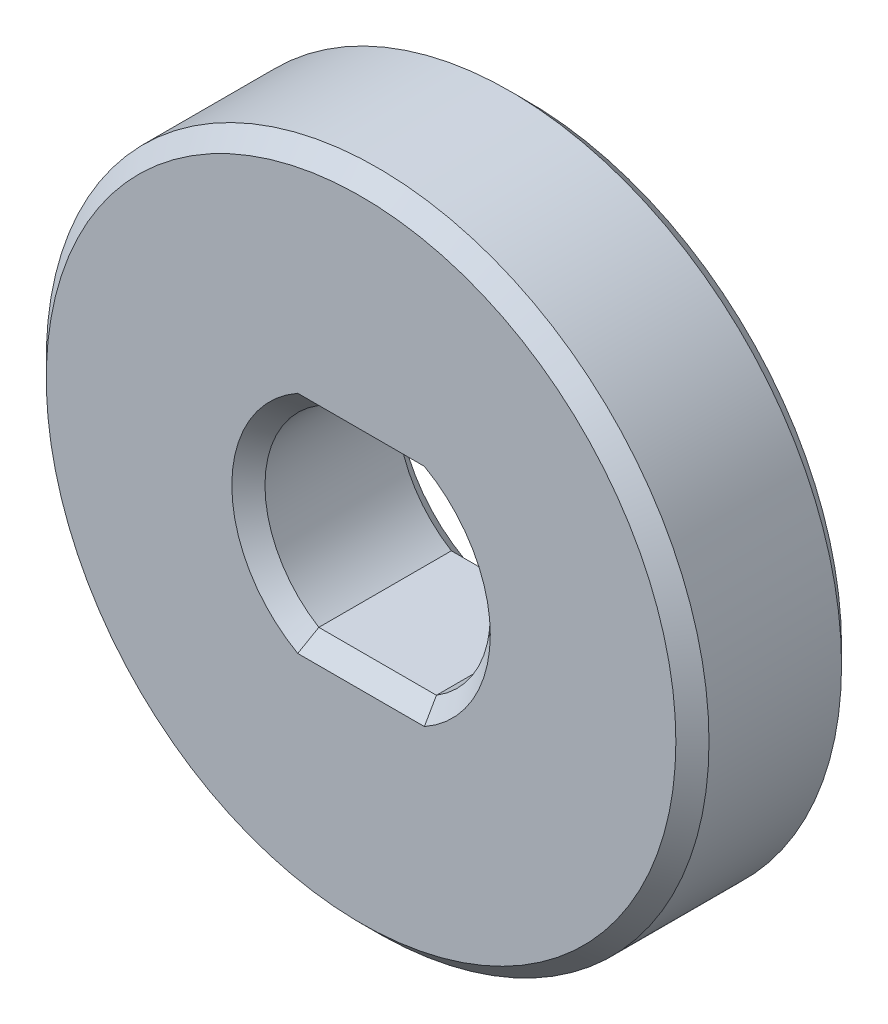
ISO-10303-21;
HEADER;
FILE_DESCRIPTION(('STEP AP214'),'2;1');
FILE_NAME('part.step','',(''),(''),'','','');
FILE_SCHEMA(('AUTOMOTIVE_DESIGN { 1 0 10303 214 1 1 1 1 }'));
ENDSEC;
DATA;
#1=APPLICATION_CONTEXT('core data for automotive mechanical design processes');
#2=APPLICATION_PROTOCOL_DEFINITION('international standard','automotive_design',2000,#1);
#3=PRODUCT_CONTEXT('',#1,'mechanical');
#4=PRODUCT('Part','Part','',(#3));
#5=PRODUCT_RELATED_PRODUCT_CATEGORY('part','',(#4));
#6=PRODUCT_DEFINITION_FORMATION('','',#4);
#7=PRODUCT_DEFINITION_CONTEXT('part definition',#1,'design');
#8=PRODUCT_DEFINITION('design','',#6,#7);
#9=PRODUCT_DEFINITION_SHAPE('','',#8);
#10=(LENGTH_UNIT() NAMED_UNIT(*) SI_UNIT(.MILLI.,.METRE.));
#11=(NAMED_UNIT(*) PLANE_ANGLE_UNIT() SI_UNIT($,.RADIAN.));
#12=(NAMED_UNIT(*) SI_UNIT($,.STERADIAN.) SOLID_ANGLE_UNIT());
#13=UNCERTAINTY_MEASURE_WITH_UNIT(LENGTH_MEASURE(1.E-05),#10,'distance_accuracy_value','');
#14=(GEOMETRIC_REPRESENTATION_CONTEXT(3) GLOBAL_UNCERTAINTY_ASSIGNED_CONTEXT((#13)) GLOBAL_UNIT_ASSIGNED_CONTEXT((#10,
#11,#12)) REPRESENTATION_CONTEXT('',''));
#15=CARTESIAN_POINT('',(0.,0.,0.));
#16=DIRECTION('',(0.,0.,1.));
#17=DIRECTION('',(1.,0.,0.));
#18=AXIS2_PLACEMENT_3D('',#15,#16,#17);
#19=CARTESIAN_POINT('',(0.,0.,5.));
#20=DIRECTION('',(0.,0.,1.));
#21=DIRECTION('',(1.,0.,0.));
#22=AXIS2_PLACEMENT_3D('',#19,#20,#21);
#23=PLANE('',#22);
#24=CARTESIAN_POINT('',(0.,0.,5.));
#25=DIRECTION('',(0.,0.,1.));
#26=DIRECTION('',(1.,0.,0.));
#27=AXIS2_PLACEMENT_3D('',#24,#25,#26);
#28=CIRCLE('',#27,3.9);
#29=CARTESIAN_POINT('',(-1.91049731745428,-3.4,5.));
#30=VERTEX_POINT('',#29);
#31=CARTESIAN_POINT('',(-1.91049731745428,3.4,5.));
#32=VERTEX_POINT('',#31);
#33=EDGE_CURVE('E72',#30,#32,#28,.F.);
#34=ORIENTED_EDGE('',*,*,#33,.T.);
#35=DIRECTION('',(1.,0.,0.));
#36=VECTOR('',#35,1.);
#37=CARTESIAN_POINT('',(0.,3.4,5.));
#38=LINE('',#37,#36);
#39=CARTESIAN_POINT('',(1.91049731745428,3.4,5.));
#40=VERTEX_POINT('',#39);
#41=EDGE_CURVE('E278',#32,#40,#38,.T.);
#42=ORIENTED_EDGE('',*,*,#41,.T.);
#43=CARTESIAN_POINT('',(0.,0.,5.));
#44=DIRECTION('',(0.,0.,1.));
#45=DIRECTION('',(1.,0.,0.));
#46=AXIS2_PLACEMENT_3D('',#43,#44,#45);
#47=CIRCLE('',#46,3.9);
#48=CARTESIAN_POINT('',(1.91049731745428,-3.4,5.));
#49=VERTEX_POINT('',#48);
#50=EDGE_CURVE('E283',#40,#49,#47,.F.);
#51=ORIENTED_EDGE('',*,*,#50,.T.);
#52=DIRECTION('',(-1.,0.,0.));
#53=VECTOR('',#52,1.);
#54=CARTESIAN_POINT('',(0.,-3.4,5.));
#55=LINE('',#54,#53);
#56=EDGE_CURVE('E286',#49,#30,#55,.T.);
#57=ORIENTED_EDGE('',*,*,#56,.T.);
#58=EDGE_LOOP('',(#34,#42,#51,#57));
#59=FACE_BOUND('',#58,.T.);
#60=CARTESIAN_POINT('',(0.,0.,5.));
#61=DIRECTION('',(0.,0.,1.));
#62=DIRECTION('',(1.,0.,0.));
#63=AXIS2_PLACEMENT_3D('',#60,#61,#62);
#64=CIRCLE('',#63,9.5);
#65=CARTESIAN_POINT('',(9.5,0.,5.));
#66=VERTEX_POINT('',#65);
#67=EDGE_CURVE('E289',#66,#66,#64,.T.);
#68=ORIENTED_EDGE('',*,*,#67,.T.);
#69=EDGE_LOOP('',(#68));
#70=FACE_BOUND('',#69,.T.);
#71=ADVANCED_FACE('F47',(#59,#70),#23,.T.);
#72=CARTESIAN_POINT('',(0.,0.,0.));
#73=DIRECTION('',(0.,0.,1.));
#74=DIRECTION('',(1.,0.,0.));
#75=AXIS2_PLACEMENT_3D('',#72,#73,#74);
#76=PLANE('',#75);
#77=DIRECTION('',(1.,0.,0.));
#78=VECTOR('',#77,1.);
#79=CARTESIAN_POINT('',(1.77482393492988,-3.4,0.));
#80=LINE('',#79,#78);
#81=CARTESIAN_POINT('',(-1.91049731745428,-3.4,0.));
#82=VERTEX_POINT('',#81);
#83=CARTESIAN_POINT('',(1.91049731745428,-3.4,0.));
#84=VERTEX_POINT('',#83);
#85=EDGE_CURVE('E136',#82,#84,#80,.T.);
#86=ORIENTED_EDGE('',*,*,#85,.T.);
#87=CARTESIAN_POINT('',(0.,0.,0.));
#88=DIRECTION('',(0.,0.,1.));
#89=DIRECTION('',(1.,0.,0.));
#90=AXIS2_PLACEMENT_3D('',#87,#88,#89);
#91=CIRCLE('',#90,3.9);
#92=CARTESIAN_POINT('',(1.91049731745428,3.4,0.));
#93=VERTEX_POINT('',#92);
#94=EDGE_CURVE('E131',#84,#93,#91,.T.);
#95=ORIENTED_EDGE('',*,*,#94,.T.);
#96=DIRECTION('',(-1.,0.,0.));
#97=VECTOR('',#96,1.);
#98=CARTESIAN_POINT('',(-1.77482393492988,3.4,0.));
#99=LINE('',#98,#97);
#100=CARTESIAN_POINT('',(-1.91049731745428,3.4,0.));
#101=VERTEX_POINT('',#100);
#102=EDGE_CURVE('E124',#93,#101,#99,.T.);
#103=ORIENTED_EDGE('',*,*,#102,.T.);
#104=CARTESIAN_POINT('',(0.,0.,0.));
#105=DIRECTION('',(0.,0.,1.));
#106=DIRECTION('',(1.,0.,0.));
#107=AXIS2_PLACEMENT_3D('',#104,#105,#106);
#108=CIRCLE('',#107,3.9);
#109=EDGE_CURVE('E128',#101,#82,#108,.T.);
#110=ORIENTED_EDGE('',*,*,#109,.T.);
#111=EDGE_LOOP('',(#86,#95,#103,#110));
#112=FACE_BOUND('',#111,.T.);
#113=CARTESIAN_POINT('',(0.,0.,0.));
#114=DIRECTION('',(0.,0.,1.));
#115=DIRECTION('',(1.,0.,0.));
#116=AXIS2_PLACEMENT_3D('',#113,#114,#115);
#117=CIRCLE('',#116,9.5);
#118=CARTESIAN_POINT('',(9.5,0.,0.));
#119=VERTEX_POINT('',#118);
#120=EDGE_CURVE('E148',#119,#119,#117,.F.);
#121=ORIENTED_EDGE('',*,*,#120,.T.);
#122=EDGE_LOOP('',(#121));
#123=FACE_BOUND('',#122,.T.);
#124=ADVANCED_FACE('F126',(#112,#123),#76,.F.);
#125=CARTESIAN_POINT('',(0.,0.,5.));
#126=DIRECTION('',(0.,0.,-1.));
#127=DIRECTION('',(-1.,0.,0.));
#128=AXIS2_PLACEMENT_3D('',#125,#126,#127);
#129=CYLINDRICAL_SURFACE('',#128,10.);
#130=CARTESIAN_POINT('',(0.,0.,0.5));
#131=DIRECTION('',(0.,0.,1.));
#132=DIRECTION('',(1.,0.,0.));
#133=AXIS2_PLACEMENT_3D('',#130,#131,#132);
#134=CIRCLE('',#133,10.);
#135=CARTESIAN_POINT('',(10.,0.,0.5));
#136=VERTEX_POINT('',#135);
#137=EDGE_CURVE('E11',#136,#136,#134,.T.);
#138=ORIENTED_EDGE('',*,*,#137,.T.);
#139=EDGE_LOOP('',(#138));
#140=FACE_BOUND('',#139,.T.);
#141=CARTESIAN_POINT('',(0.,0.,4.5));
#142=DIRECTION('',(0.,0.,1.));
#143=DIRECTION('',(1.,0.,0.));
#144=AXIS2_PLACEMENT_3D('',#141,#142,#143);
#145=CIRCLE('',#144,10.);
#146=CARTESIAN_POINT('',(10.,0.,4.5));
#147=VERTEX_POINT('',#146);
#148=EDGE_CURVE('E64',#147,#147,#145,.F.);
#149=ORIENTED_EDGE('',*,*,#148,.T.);
#150=EDGE_LOOP('',(#149));
#151=FACE_BOUND('',#150,.T.);
#152=ADVANCED_FACE('F254',(#140,#151),#129,.T.);
#153=CARTESIAN_POINT('',(0.,0.,5.));
#154=DIRECTION('',(0.,0.,-1.));
#155=DIRECTION('',(-1.,0.,0.));
#156=AXIS2_PLACEMENT_3D('',#153,#154,#155);
#157=CYLINDRICAL_SURFACE('',#156,3.4);
#158=DIRECTION('',(0.,0.,-1.));
#159=VECTOR('',#158,1.);
#160=CARTESIAN_POINT('',(-1.77482393492988,-2.9,5.));
#161=LINE('',#160,#159);
#162=CARTESIAN_POINT('',(-1.77482393492988,-2.9,4.5));
#163=VERTEX_POINT('',#162);
#164=CARTESIAN_POINT('',(-1.77482393492988,-2.9,0.500000000000003));
#165=VERTEX_POINT('',#164);
#166=EDGE_CURVE('E325',#163,#165,#161,.T.);
#167=ORIENTED_EDGE('',*,*,#166,.T.);
#168=CARTESIAN_POINT('',(0.,0.,0.500000000000003));
#169=DIRECTION('',(0.,0.,1.));
#170=DIRECTION('',(1.,0.,0.));
#171=AXIS2_PLACEMENT_3D('',#168,#169,#170);
#172=CIRCLE('',#171,3.4);
#173=CARTESIAN_POINT('',(-1.77482393492988,2.9,0.500000000000003));
#174=VERTEX_POINT('',#173);
#175=EDGE_CURVE('E293',#165,#174,#172,.F.);
#176=ORIENTED_EDGE('',*,*,#175,.T.);
#177=DIRECTION('',(0.,0.,-1.));
#178=VECTOR('',#177,1.);
#179=CARTESIAN_POINT('',(-1.77482393492988,2.9,5.));
#180=LINE('',#179,#178);
#181=CARTESIAN_POINT('',(-1.77482393492988,2.9,4.5));
#182=VERTEX_POINT('',#181);
#183=EDGE_CURVE('E157',#182,#174,#180,.T.);
#184=ORIENTED_EDGE('',*,*,#183,.F.);
#185=CARTESIAN_POINT('',(0.,0.,4.5));
#186=DIRECTION('',(0.,0.,1.));
#187=DIRECTION('',(1.,0.,0.));
#188=AXIS2_PLACEMENT_3D('',#185,#186,#187);
#189=CIRCLE('',#188,3.4);
#190=EDGE_CURVE('E296',#182,#163,#189,.T.);
#191=ORIENTED_EDGE('',*,*,#190,.T.);
#192=EDGE_LOOP('',(#167,#176,#184,#191));
#193=FACE_BOUND('',#192,.T.);
#194=ADVANCED_FACE('F258',(#193),#157,.F.);
#195=CARTESIAN_POINT('',(-1.77482393492988,-2.9,5.));
#196=DIRECTION('',(0.,1.,0.));
#197=DIRECTION('',(0.,0.,1.));
#198=AXIS2_PLACEMENT_3D('',#195,#196,#197);
#199=PLANE('',#198);
#200=DIRECTION('',(0.,0.,-1.));
#201=VECTOR('',#200,1.);
#202=CARTESIAN_POINT('',(1.77482393492988,-2.9,5.));
#203=LINE('',#202,#201);
#204=CARTESIAN_POINT('',(1.77482393492988,-2.9,4.5));
#205=VERTEX_POINT('',#204);
#206=CARTESIAN_POINT('',(1.77482393492988,-2.9,0.500000000000003));
#207=VERTEX_POINT('',#206);
#208=EDGE_CURVE('E329',#205,#207,#203,.T.);
#209=ORIENTED_EDGE('',*,*,#208,.T.);
#210=DIRECTION('',(-1.,0.,0.));
#211=VECTOR('',#210,1.);
#212=CARTESIAN_POINT('',(-1.77482393492988,-2.9,0.500000000000003));
#213=LINE('',#212,#211);
#214=EDGE_CURVE('E299',#207,#165,#213,.T.);
#215=ORIENTED_EDGE('',*,*,#214,.T.);
#216=ORIENTED_EDGE('',*,*,#166,.F.);
#217=DIRECTION('',(1.,0.,0.));
#218=VECTOR('',#217,1.);
#219=CARTESIAN_POINT('',(-1.77482393492988,-2.9,4.5));
#220=LINE('',#219,#218);
#221=EDGE_CURVE('E302',#163,#205,#220,.T.);
#222=ORIENTED_EDGE('',*,*,#221,.T.);
#223=EDGE_LOOP('',(#209,#215,#216,#222));
#224=FACE_BOUND('',#223,.T.);
#225=ADVANCED_FACE('F354',(#224),#199,.T.);
#226=CARTESIAN_POINT('',(0.,0.,5.));
#227=DIRECTION('',(0.,0.,-1.));
#228=DIRECTION('',(-1.,0.,0.));
#229=AXIS2_PLACEMENT_3D('',#226,#227,#228);
#230=CYLINDRICAL_SURFACE('',#229,3.4);
#231=DIRECTION('',(0.,0.,-1.));
#232=VECTOR('',#231,1.);
#233=CARTESIAN_POINT('',(1.77482393492988,2.9,5.));
#234=LINE('',#233,#232);
#235=CARTESIAN_POINT('',(1.77482393492988,2.9,4.5));
#236=VERTEX_POINT('',#235);
#237=CARTESIAN_POINT('',(1.77482393492988,2.9,0.500000000000003));
#238=VERTEX_POINT('',#237);
#239=EDGE_CURVE('E333',#236,#238,#234,.T.);
#240=ORIENTED_EDGE('',*,*,#239,.T.);
#241=CARTESIAN_POINT('',(0.,0.,0.500000000000003));
#242=DIRECTION('',(0.,0.,1.));
#243=DIRECTION('',(1.,0.,0.));
#244=AXIS2_PLACEMENT_3D('',#241,#242,#243);
#245=CIRCLE('',#244,3.4);
#246=EDGE_CURVE('E311',#238,#207,#245,.F.);
#247=ORIENTED_EDGE('',*,*,#246,.T.);
#248=ORIENTED_EDGE('',*,*,#208,.F.);
#249=CARTESIAN_POINT('',(0.,0.,4.5));
#250=DIRECTION('',(0.,0.,1.));
#251=DIRECTION('',(1.,0.,0.));
#252=AXIS2_PLACEMENT_3D('',#249,#250,#251);
#253=CIRCLE('',#252,3.4);
#254=EDGE_CURVE('E315',#205,#236,#253,.T.);
#255=ORIENTED_EDGE('',*,*,#254,.T.);
#256=EDGE_LOOP('',(#240,#247,#248,#255));
#257=FACE_BOUND('',#256,.T.);
#258=ADVANCED_FACE('F351',(#257),#230,.F.);
#259=CARTESIAN_POINT('',(-1.77482393492988,2.9,5.));
#260=DIRECTION('',(0.,-1.,0.));
#261=DIRECTION('',(0.,0.,-1.));
#262=AXIS2_PLACEMENT_3D('',#259,#260,#261);
#263=PLANE('',#262);
#264=ORIENTED_EDGE('',*,*,#183,.T.);
#265=DIRECTION('',(1.,0.,0.));
#266=VECTOR('',#265,1.);
#267=CARTESIAN_POINT('',(1.77482393492988,2.9,0.500000000000003));
#268=LINE('',#267,#266);
#269=EDGE_CURVE('E151',#174,#238,#268,.T.);
#270=ORIENTED_EDGE('',*,*,#269,.T.);
#271=ORIENTED_EDGE('',*,*,#239,.F.);
#272=DIRECTION('',(-1.,0.,0.));
#273=VECTOR('',#272,1.);
#274=CARTESIAN_POINT('',(-1.77482393492988,2.9,4.5));
#275=LINE('',#274,#273);
#276=EDGE_CURVE('E307',#236,#182,#275,.T.);
#277=ORIENTED_EDGE('',*,*,#276,.T.);
#278=EDGE_LOOP('',(#264,#270,#271,#277));
#279=FACE_BOUND('',#278,.T.);
#280=ADVANCED_FACE('F189',(#279),#263,.T.);
#281=CARTESIAN_POINT('',(0.,0.,0.));
#282=DIRECTION('',(0.,0.,-1.));
#283=DIRECTION('',(-1.,0.,0.));
#284=AXIS2_PLACEMENT_3D('',#281,#282,#283);
#285=CONICAL_SURFACE('',#284,3.9,0.785398163397446);
#286=CARTESIAN_POINT('',(-1.91049731745428,3.4,0.));
#287=CARTESIAN_POINT('',(-1.88868775174762,3.31655783509642,0.0834421649035857));
#288=CARTESIAN_POINT('',(-1.86647686298808,3.2331701190481,0.166829880951899));
#289=CARTESIAN_POINT('',(-1.82125240342238,3.06650345220835,0.333496547791654));
#290=CARTESIAN_POINT('',(-1.79823883134045,2.98322450158999,0.416775498410008));
#291=CARTESIAN_POINT('',(-1.77482393492988,2.9,0.500000000000003));
#292=B_SPLINE_CURVE_WITH_KNOTS('',3,(#286,#287,#288,#289,#290,#291),.UNSPECIFIED.,.F.,.F.,(4,2,
4),(0.,0.360004324411487,0.720009221030168),.UNSPECIFIED.);
#293=EDGE_CURVE('E142',#174,#101,#292,.F.);
#294=ORIENTED_EDGE('',*,*,#293,.F.);
#295=ORIENTED_EDGE('',*,*,#175,.F.);
#296=CARTESIAN_POINT('',(-1.77482393492988,-2.9,0.500000000000003));
#297=CARTESIAN_POINT('',(-1.79823883134045,-2.98322450158999,0.416775498410008));
#298=CARTESIAN_POINT('',(-1.82125240342238,-3.06650345220835,0.333496547791654));
#299=CARTESIAN_POINT('',(-1.86647686298808,-3.2331701190481,0.166829880951899));
#300=CARTESIAN_POINT('',(-1.88868775174762,-3.31655783509642,0.0834421649035858));
#301=CARTESIAN_POINT('',(-1.91049731745428,-3.4,0.));
#302=B_SPLINE_CURVE_WITH_KNOTS('',3,(#296,#297,#298,#299,#300,#301),.UNSPECIFIED.,.F.,.F.,(4,2,
4),(0.,0.360004896618681,0.720009221030168),.UNSPECIFIED.);
#303=EDGE_CURVE('E145',#82,#165,#302,.F.);
#304=ORIENTED_EDGE('',*,*,#303,.F.);
#305=ORIENTED_EDGE('',*,*,#109,.F.);
#306=EDGE_LOOP('',(#294,#295,#304,#305));
#307=FACE_BOUND('',#306,.T.);
#308=ADVANCED_FACE('F140',(#307),#285,.F.);
#309=CARTESIAN_POINT('',(0.,-3.4,0.));
#310=DIRECTION('',(0.,0.707106781186549,-0.707106781186546));
#311=DIRECTION('',(-1.,0.,0.));
#312=AXIS2_PLACEMENT_3D('',#309,#310,#311);
#313=PLANE('',#312);
#314=ORIENTED_EDGE('',*,*,#303,.T.);
#315=ORIENTED_EDGE('',*,*,#214,.F.);
#316=CARTESIAN_POINT('',(1.77482393492988,-2.9,0.500000000000003));
#317=CARTESIAN_POINT('',(1.79823883134045,-2.98322450159,0.416775498410008));
#318=CARTESIAN_POINT('',(1.82125240342238,-3.06650345220835,0.333496547791654));
#319=CARTESIAN_POINT('',(1.86647686298808,-3.2331701190481,0.166829880951899));
#320=CARTESIAN_POINT('',(1.88868775174762,-3.31655783509642,0.0834421649035858));
#321=CARTESIAN_POINT('',(1.91049731745428,-3.4,0.));
#322=B_SPLINE_CURVE_WITH_KNOTS('',3,(#316,#317,#318,#319,#320,#321),.UNSPECIFIED.,.F.,.F.,(4,2,
4),(0.,0.36000489661868,0.720009221030168),.UNSPECIFIED.);
#323=EDGE_CURVE('E153',#84,#207,#322,.F.);
#324=ORIENTED_EDGE('',*,*,#323,.F.);
#325=ORIENTED_EDGE('',*,*,#85,.F.);
#326=EDGE_LOOP('',(#314,#315,#324,#325));
#327=FACE_BOUND('',#326,.T.);
#328=ADVANCED_FACE('F188',(#327),#313,.T.);
#329=CARTESIAN_POINT('',(0.,3.4,0.));
#330=DIRECTION('',(0.,-0.707106781186549,-0.707106781186546));
#331=DIRECTION('',(1.,0.,0.));
#332=AXIS2_PLACEMENT_3D('',#329,#330,#331);
#333=PLANE('',#332);
#334=ORIENTED_EDGE('',*,*,#293,.T.);
#335=ORIENTED_EDGE('',*,*,#102,.F.);
#336=CARTESIAN_POINT('',(1.91049731745428,3.4,0.));
#337=CARTESIAN_POINT('',(1.88868775174762,3.31655783509642,0.0834421649035857));
#338=CARTESIAN_POINT('',(1.86647686298808,3.2331701190481,0.166829880951899));
#339=CARTESIAN_POINT('',(1.82125240342238,3.06650345220835,0.333496547791654));
#340=CARTESIAN_POINT('',(1.79823883134045,2.98322450158999,0.416775498410008));
#341=CARTESIAN_POINT('',(1.77482393492988,2.9,0.500000000000003));
#342=B_SPLINE_CURVE_WITH_KNOTS('',3,(#336,#337,#338,#339,#340,#341),.UNSPECIFIED.,.F.,.F.,(4,2,
4),(0.,0.360004324411487,0.720009221030168),.UNSPECIFIED.);
#343=EDGE_CURVE('E159',#238,#93,#342,.F.);
#344=ORIENTED_EDGE('',*,*,#343,.F.);
#345=ORIENTED_EDGE('',*,*,#269,.F.);
#346=EDGE_LOOP('',(#334,#335,#344,#345));
#347=FACE_BOUND('',#346,.T.);
#348=ADVANCED_FACE('F150',(#347),#333,.T.);
#349=CARTESIAN_POINT('',(0.,0.,0.));
#350=DIRECTION('',(0.,0.,-1.));
#351=DIRECTION('',(-1.,0.,0.));
#352=AXIS2_PLACEMENT_3D('',#349,#350,#351);
#353=CONICAL_SURFACE('',#352,3.9,0.785398163397446);
#354=ORIENTED_EDGE('',*,*,#323,.T.);
#355=ORIENTED_EDGE('',*,*,#246,.F.);
#356=ORIENTED_EDGE('',*,*,#343,.T.);
#357=ORIENTED_EDGE('',*,*,#94,.F.);
#358=EDGE_LOOP('',(#354,#355,#356,#357));
#359=FACE_BOUND('',#358,.T.);
#360=ADVANCED_FACE('F236',(#359),#353,.F.);
#361=CARTESIAN_POINT('',(-1.77482393492988,-2.9,4.5));
#362=DIRECTION('',(0.,-0.707106781186545,-0.70710678118655));
#363=DIRECTION('',(1.,0.,0.));
#364=AXIS2_PLACEMENT_3D('',#361,#362,#363);
#365=PLANE('',#364);
#366=CARTESIAN_POINT('',(-1.77482393492988,-2.9,4.5));
#367=CARTESIAN_POINT('',(-1.79823883134045,-2.98322450159,4.58322450158999));
#368=CARTESIAN_POINT('',(-1.82125240342238,-3.06650345220835,4.66650345220835));
#369=CARTESIAN_POINT('',(-1.86647686298808,-3.2331701190481,4.8331701190481));
#370=CARTESIAN_POINT('',(-1.88868775174762,-3.31655783509642,4.91655783509642));
#371=CARTESIAN_POINT('',(-1.91049731745428,-3.4,5.));
#372=B_SPLINE_CURVE_WITH_KNOTS('',3,(#366,#367,#368,#369,#370,#371),.UNSPECIFIED.,.F.,.F.,(4,2,
4),(0.,0.36000489661868,0.720009221030168),.UNSPECIFIED.);
#373=EDGE_CURVE('E216',#30,#163,#372,.F.);
#374=ORIENTED_EDGE('',*,*,#373,.F.);
#375=ORIENTED_EDGE('',*,*,#56,.F.);
#376=CARTESIAN_POINT('',(1.91049731745428,-3.4,5.));
#377=CARTESIAN_POINT('',(1.88868775174762,-3.31655783509642,4.91655783509642));
#378=CARTESIAN_POINT('',(1.86647686298808,-3.2331701190481,4.8331701190481));
#379=CARTESIAN_POINT('',(1.82125240342238,-3.06650345220835,4.66650345220835));
#380=CARTESIAN_POINT('',(1.79823883134045,-2.98322450159,4.58322450158999));
#381=CARTESIAN_POINT('',(1.77482393492988,-2.9,4.5));
#382=B_SPLINE_CURVE_WITH_KNOTS('',3,(#376,#377,#378,#379,#380,#381),.UNSPECIFIED.,.F.,.F.,(4,2,
4),(0.,0.360004324411488,0.720009221030169),.UNSPECIFIED.);
#383=EDGE_CURVE('E52',#205,#49,#382,.F.);
#384=ORIENTED_EDGE('',*,*,#383,.F.);
#385=ORIENTED_EDGE('',*,*,#221,.F.);
#386=EDGE_LOOP('',(#374,#375,#384,#385));
#387=FACE_BOUND('',#386,.T.);
#388=ADVANCED_FACE('F228',(#387),#365,.F.);
#389=CARTESIAN_POINT('',(0.,0.,4.5));
#390=DIRECTION('',(0.,0.,1.));
#391=DIRECTION('',(1.,0.,0.));
#392=AXIS2_PLACEMENT_3D('',#389,#390,#391);
#393=CONICAL_SURFACE('',#392,3.4,0.785398163397452);
#394=ORIENTED_EDGE('',*,*,#383,.T.);
#395=ORIENTED_EDGE('',*,*,#50,.F.);
#396=CARTESIAN_POINT('',(1.91049731745428,3.4,5.));
#397=CARTESIAN_POINT('',(1.88868775174762,3.31655783509642,4.91655783509642));
#398=CARTESIAN_POINT('',(1.86647686298808,3.2331701190481,4.8331701190481));
#399=CARTESIAN_POINT('',(1.82125240342238,3.06650345220835,4.66650345220835));
#400=CARTESIAN_POINT('',(1.79823883134045,2.98322450159,4.58322450158999));
#401=CARTESIAN_POINT('',(1.77482393492988,2.9,4.5));
#402=B_SPLINE_CURVE_WITH_KNOTS('',3,(#396,#397,#398,#399,#400,#401),.UNSPECIFIED.,.F.,.F.,(4,2,
4),(0.,0.360004324411488,0.720009221030169),.UNSPECIFIED.);
#403=EDGE_CURVE('E79',#236,#40,#402,.F.);
#404=ORIENTED_EDGE('',*,*,#403,.F.);
#405=ORIENTED_EDGE('',*,*,#254,.F.);
#406=EDGE_LOOP('',(#394,#395,#404,#405));
#407=FACE_BOUND('',#406,.T.);
#408=ADVANCED_FACE('F222',(#407),#393,.F.);
#409=CARTESIAN_POINT('',(0.,0.,4.5));
#410=DIRECTION('',(0.,0.,1.));
#411=DIRECTION('',(1.,0.,0.));
#412=AXIS2_PLACEMENT_3D('',#409,#410,#411);
#413=CONICAL_SURFACE('',#412,3.4,0.785398163397452);
#414=ORIENTED_EDGE('',*,*,#373,.T.);
#415=ORIENTED_EDGE('',*,*,#190,.F.);
#416=CARTESIAN_POINT('',(-1.77482393492988,2.9,4.5));
#417=CARTESIAN_POINT('',(-1.79823883134045,2.98322450159,4.58322450158999));
#418=CARTESIAN_POINT('',(-1.82125240342238,3.06650345220835,4.66650345220835));
#419=CARTESIAN_POINT('',(-1.86647686298808,3.2331701190481,4.8331701190481));
#420=CARTESIAN_POINT('',(-1.88868775174762,3.31655783509642,4.91655783509642));
#421=CARTESIAN_POINT('',(-1.91049731745428,3.4,5.));
#422=B_SPLINE_CURVE_WITH_KNOTS('',3,(#416,#417,#418,#419,#420,#421),.UNSPECIFIED.,.F.,.F.,(4,2,
4),(0.,0.36000489661868,0.720009221030168),.UNSPECIFIED.);
#423=EDGE_CURVE('E205',#32,#182,#422,.F.);
#424=ORIENTED_EDGE('',*,*,#423,.F.);
#425=ORIENTED_EDGE('',*,*,#33,.F.);
#426=EDGE_LOOP('',(#414,#415,#424,#425));
#427=FACE_BOUND('',#426,.T.);
#428=ADVANCED_FACE('F202',(#427),#413,.F.);
#429=CARTESIAN_POINT('',(-1.77482393492988,2.9,4.5));
#430=DIRECTION('',(0.,0.707106781186545,-0.70710678118655));
#431=DIRECTION('',(-1.,0.,0.));
#432=AXIS2_PLACEMENT_3D('',#429,#430,#431);
#433=PLANE('',#432);
#434=ORIENTED_EDGE('',*,*,#403,.T.);
#435=ORIENTED_EDGE('',*,*,#41,.F.);
#436=ORIENTED_EDGE('',*,*,#423,.T.);
#437=ORIENTED_EDGE('',*,*,#276,.F.);
#438=EDGE_LOOP('',(#434,#435,#436,#437));
#439=FACE_BOUND('',#438,.T.);
#440=ADVANCED_FACE('F192',(#439),#433,.F.);
#441=CARTESIAN_POINT('',(0.,0.,0.5));
#442=DIRECTION('',(0.,0.,1.));
#443=DIRECTION('',(1.,0.,0.));
#444=AXIS2_PLACEMENT_3D('',#441,#442,#443);
#445=CONICAL_SURFACE('',#444,10.,0.785398163397452);
#446=ORIENTED_EDGE('',*,*,#120,.F.);
#447=EDGE_LOOP('',(#446));
#448=FACE_BOUND('',#447,.T.);
#449=ORIENTED_EDGE('',*,*,#137,.F.);
#450=EDGE_LOOP('',(#449));
#451=FACE_BOUND('',#450,.T.);
#452=ADVANCED_FACE('F201',(#448,#451),#445,.T.);
#453=CARTESIAN_POINT('',(0.,0.,5.));
#454=DIRECTION('',(0.,0.,-1.));
#455=DIRECTION('',(-1.,0.,0.));
#456=AXIS2_PLACEMENT_3D('',#453,#454,#455);
#457=CONICAL_SURFACE('',#456,9.5,0.785398163397445);
#458=ORIENTED_EDGE('',*,*,#148,.F.);
#459=EDGE_LOOP('',(#458));
#460=FACE_BOUND('',#459,.T.);
#461=ORIENTED_EDGE('',*,*,#67,.F.);
#462=EDGE_LOOP('',(#461));
#463=FACE_BOUND('',#462,.T.);
#464=ADVANCED_FACE('F50',(#460,#463),#457,.T.);
#465=CLOSED_SHELL('',(#71,#124,#152,#194,#225,#258,#280,#308,#328,#348,#360,#388,#408,#428,#440,
#452,#464));
#466=MANIFOLD_SOLID_BREP('B2',#465);
#467=ADVANCED_BREP_SHAPE_REPRESENTATION('',(#18,#466),#14);
#468=SHAPE_DEFINITION_REPRESENTATION(#9,#467);
ENDSEC;
END-ISO-10303-21;
